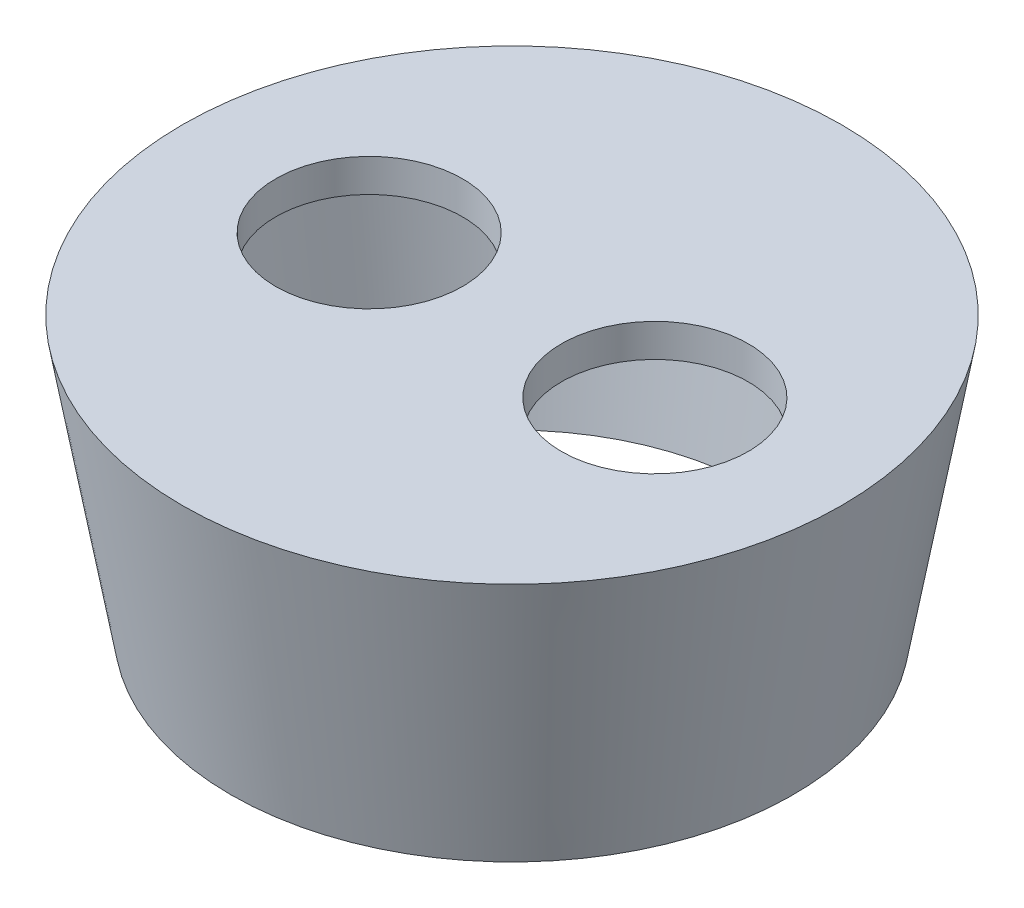
ISO-10303-21;
HEADER;
FILE_DESCRIPTION(('STEP AP214'),'2;1');
FILE_NAME('part.step','',(''),(''),'','','');
FILE_SCHEMA(('AUTOMOTIVE_DESIGN { 1 0 10303 214 1 1 1 1 }'));
ENDSEC;
DATA;
#1=APPLICATION_CONTEXT('core data for automotive mechanical design processes');
#2=APPLICATION_PROTOCOL_DEFINITION('international standard','automotive_design',2000,#1);
#3=PRODUCT_CONTEXT('',#1,'mechanical');
#4=PRODUCT('Part','Part','',(#3));
#5=PRODUCT_RELATED_PRODUCT_CATEGORY('part','',(#4));
#6=PRODUCT_DEFINITION_FORMATION('','',#4);
#7=PRODUCT_DEFINITION_CONTEXT('part definition',#1,'design');
#8=PRODUCT_DEFINITION('design','',#6,#7);
#9=PRODUCT_DEFINITION_SHAPE('','',#8);
#10=(LENGTH_UNIT() NAMED_UNIT(*) SI_UNIT(.MILLI.,.METRE.));
#11=(NAMED_UNIT(*) PLANE_ANGLE_UNIT() SI_UNIT($,.RADIAN.));
#12=(NAMED_UNIT(*) SI_UNIT($,.STERADIAN.) SOLID_ANGLE_UNIT());
#13=UNCERTAINTY_MEASURE_WITH_UNIT(LENGTH_MEASURE(1.E-05),#10,'distance_accuracy_value','');
#14=(GEOMETRIC_REPRESENTATION_CONTEXT(3) GLOBAL_UNCERTAINTY_ASSIGNED_CONTEXT((#13)) GLOBAL_UNIT_ASSIGNED_CONTEXT((#10,
#11,#12)) REPRESENTATION_CONTEXT('',''));
#15=CARTESIAN_POINT('',(0.,0.,0.));
#16=DIRECTION('',(0.,0.,1.));
#17=DIRECTION('',(1.,0.,0.));
#18=AXIS2_PLACEMENT_3D('',#15,#16,#17);
#19=CARTESIAN_POINT('',(0.,0.,0.));
#20=DIRECTION('',(0.,1.,0.));
#21=DIRECTION('',(0.,0.,1.));
#22=AXIS2_PLACEMENT_3D('',#19,#20,#21);
#23=CONICAL_SURFACE('',#22,30.,0.174532925199433);
#24=CARTESIAN_POINT('',(0.,-25.,0.));
#25=DIRECTION('',(0.,1.,0.));
#26=DIRECTION('',(0.,0.,1.));
#27=AXIS2_PLACEMENT_3D('',#24,#25,#26);
#28=CIRCLE('',#27,25.5918254822884);
#29=CARTESIAN_POINT('',(0.,-25.,25.5918254822884));
#30=VERTEX_POINT('',#29);
#31=EDGE_CURVE('E10',#30,#30,#28,.T.);
#32=ORIENTED_EDGE('',*,*,#31,.T.);
#33=EDGE_LOOP('',(#32));
#34=FACE_BOUND('',#33,.T.);
#35=CARTESIAN_POINT('',(0.,0.,0.));
#36=DIRECTION('',(0.,1.,0.));
#37=DIRECTION('',(0.,0.,1.));
#38=AXIS2_PLACEMENT_3D('',#35,#36,#37);
#39=CIRCLE('',#38,30.);
#40=CARTESIAN_POINT('',(0.,0.,30.));
#41=VERTEX_POINT('',#40);
#42=EDGE_CURVE('E44',#41,#41,#39,.T.);
#43=ORIENTED_EDGE('',*,*,#42,.F.);
#44=EDGE_LOOP('',(#43));
#45=FACE_BOUND('',#44,.T.);
#46=ADVANCED_FACE('F37',(#34,#45),#23,.T.);
#47=CARTESIAN_POINT('',(0.,-25.,0.));
#48=DIRECTION('',(0.,1.,0.));
#49=DIRECTION('',(0.,0.,1.));
#50=AXIS2_PLACEMENT_3D('',#47,#48,#49);
#51=PLANE('',#50);
#52=CARTESIAN_POINT('',(0.,-25.,0.));
#53=DIRECTION('',(0.,1.,0.));
#54=DIRECTION('',(0.,0.,1.));
#55=AXIS2_PLACEMENT_3D('',#52,#53,#54);
#56=CIRCLE('',#55,22.5455456466311);
#57=CARTESIAN_POINT('',(0.,-25.,22.5455456466311));
#58=VERTEX_POINT('',#57);
#59=EDGE_CURVE('E49',#58,#58,#56,.T.);
#60=ORIENTED_EDGE('',*,*,#59,.T.);
#61=EDGE_LOOP('',(#60));
#62=FACE_BOUND('',#61,.T.);
#63=ORIENTED_EDGE('',*,*,#31,.F.);
#64=EDGE_LOOP('',(#63));
#65=FACE_BOUND('',#64,.T.);
#66=ADVANCED_FACE('F83',(#62,#65),#51,.F.);
#67=CARTESIAN_POINT('',(0.,0.,0.));
#68=DIRECTION('',(0.,1.,0.));
#69=DIRECTION('',(0.,0.,1.));
#70=AXIS2_PLACEMENT_3D('',#67,#68,#69);
#71=PLANE('',#70);
#72=CARTESIAN_POINT('',(-13.,0.,0.));
#73=DIRECTION('',(0.,1.,0.));
#74=DIRECTION('',(0.,0.,1.));
#75=AXIS2_PLACEMENT_3D('',#72,#73,#74);
#76=CIRCLE('',#75,8.5);
#77=CARTESIAN_POINT('',(-13.,0.,8.5));
#78=VERTEX_POINT('',#77);
#79=EDGE_CURVE('E65',#78,#78,#76,.T.);
#80=ORIENTED_EDGE('',*,*,#79,.F.);
#81=EDGE_LOOP('',(#80));
#82=FACE_BOUND('',#81,.T.);
#83=CARTESIAN_POINT('',(13.,0.,0.));
#84=DIRECTION('',(0.,1.,0.));
#85=DIRECTION('',(0.,0.,1.));
#86=AXIS2_PLACEMENT_3D('',#83,#84,#85);
#87=CIRCLE('',#86,8.5);
#88=CARTESIAN_POINT('',(13.,0.,8.5));
#89=VERTEX_POINT('',#88);
#90=EDGE_CURVE('E61',#89,#89,#87,.T.);
#91=ORIENTED_EDGE('',*,*,#90,.F.);
#92=EDGE_LOOP('',(#91));
#93=FACE_BOUND('',#92,.T.);
#94=ORIENTED_EDGE('',*,*,#42,.T.);
#95=EDGE_LOOP('',(#94));
#96=FACE_BOUND('',#95,.T.);
#97=ADVANCED_FACE('F79',(#82,#93,#96),#71,.T.);
#98=CARTESIAN_POINT('',(0.,0.520944533000792,0.));
#99=DIRECTION('',(0.,1.,0.));
#100=DIRECTION('',(0.,0.,1.));
#101=AXIS2_PLACEMENT_3D('',#98,#99,#100);
#102=CONICAL_SURFACE('',#101,27.0455767409634,0.174532925199433);
#103=ORIENTED_EDGE('',*,*,#59,.F.);
#104=EDGE_LOOP('',(#103));
#105=FACE_BOUND('',#104,.T.);
#106=CARTESIAN_POINT('',(0.,-3.,0.));
#107=DIRECTION('',(0.,1.,0.));
#108=DIRECTION('',(0.,0.,1.));
#109=AXIS2_PLACEMENT_3D('',#106,#107,#108);
#110=CIRCLE('',#109,26.4247392222174);
#111=CARTESIAN_POINT('',(0.,-3.,26.4247392222174));
#112=VERTEX_POINT('',#111);
#113=EDGE_CURVE('E54',#112,#112,#110,.T.);
#114=ORIENTED_EDGE('',*,*,#113,.T.);
#115=EDGE_LOOP('',(#114));
#116=FACE_BOUND('',#115,.T.);
#117=ADVANCED_FACE('F82',(#105,#116),#102,.F.);
#118=CARTESIAN_POINT('',(0.,-3.,0.));
#119=DIRECTION('',(0.,1.,0.));
#120=DIRECTION('',(0.,0.,1.));
#121=AXIS2_PLACEMENT_3D('',#118,#119,#120);
#122=PLANE('',#121);
#123=CARTESIAN_POINT('',(-13.,-3.,0.));
#124=DIRECTION('',(0.,1.,0.));
#125=DIRECTION('',(0.,0.,1.));
#126=AXIS2_PLACEMENT_3D('',#123,#124,#125);
#127=CIRCLE('',#126,8.5);
#128=CARTESIAN_POINT('',(-13.,-3.,8.5));
#129=VERTEX_POINT('',#128);
#130=EDGE_CURVE('E60',#129,#129,#127,.F.);
#131=ORIENTED_EDGE('',*,*,#130,.F.);
#132=EDGE_LOOP('',(#131));
#133=FACE_BOUND('',#132,.T.);
#134=CARTESIAN_POINT('',(13.,-3.,0.));
#135=DIRECTION('',(0.,1.,0.));
#136=DIRECTION('',(0.,0.,1.));
#137=AXIS2_PLACEMENT_3D('',#134,#135,#136);
#138=CIRCLE('',#137,8.5);
#139=CARTESIAN_POINT('',(13.,-3.,8.5));
#140=VERTEX_POINT('',#139);
#141=EDGE_CURVE('E66',#140,#140,#138,.F.);
#142=ORIENTED_EDGE('',*,*,#141,.F.);
#143=EDGE_LOOP('',(#142));
#144=FACE_BOUND('',#143,.T.);
#145=ORIENTED_EDGE('',*,*,#113,.F.);
#146=EDGE_LOOP('',(#145));
#147=FACE_BOUND('',#146,.T.);
#148=ADVANCED_FACE('F88',(#133,#144,#147),#122,.F.);
#149=CARTESIAN_POINT('',(13.,-27.0416305603426,0.));
#150=DIRECTION('',(0.,1.,0.));
#151=DIRECTION('',(0.,0.,1.));
#152=AXIS2_PLACEMENT_3D('',#149,#150,#151);
#153=CYLINDRICAL_SURFACE('',#152,8.5);
#154=ORIENTED_EDGE('',*,*,#141,.T.);
#155=EDGE_LOOP('',(#154));
#156=FACE_BOUND('',#155,.T.);
#157=ORIENTED_EDGE('',*,*,#90,.T.);
#158=EDGE_LOOP('',(#157));
#159=FACE_BOUND('',#158,.T.);
#160=ADVANCED_FACE('F86',(#156,#159),#153,.F.);
#161=CARTESIAN_POINT('',(-13.,-27.0416305603426,0.));
#162=DIRECTION('',(0.,1.,0.));
#163=DIRECTION('',(0.,0.,1.));
#164=AXIS2_PLACEMENT_3D('',#161,#162,#163);
#165=CYLINDRICAL_SURFACE('',#164,8.5);
#166=ORIENTED_EDGE('',*,*,#130,.T.);
#167=EDGE_LOOP('',(#166));
#168=FACE_BOUND('',#167,.T.);
#169=ORIENTED_EDGE('',*,*,#79,.T.);
#170=EDGE_LOOP('',(#169));
#171=FACE_BOUND('',#170,.T.);
#172=ADVANCED_FACE('F77',(#168,#171),#165,.F.);
#173=CLOSED_SHELL('',(#46,#66,#97,#117,#148,#160,#172));
#174=MANIFOLD_SOLID_BREP('B2',#173);
#175=ADVANCED_BREP_SHAPE_REPRESENTATION('',(#18,#174),#14);
#176=SHAPE_DEFINITION_REPRESENTATION(#9,#175);
ENDSEC;
END-ISO-10303-21;
